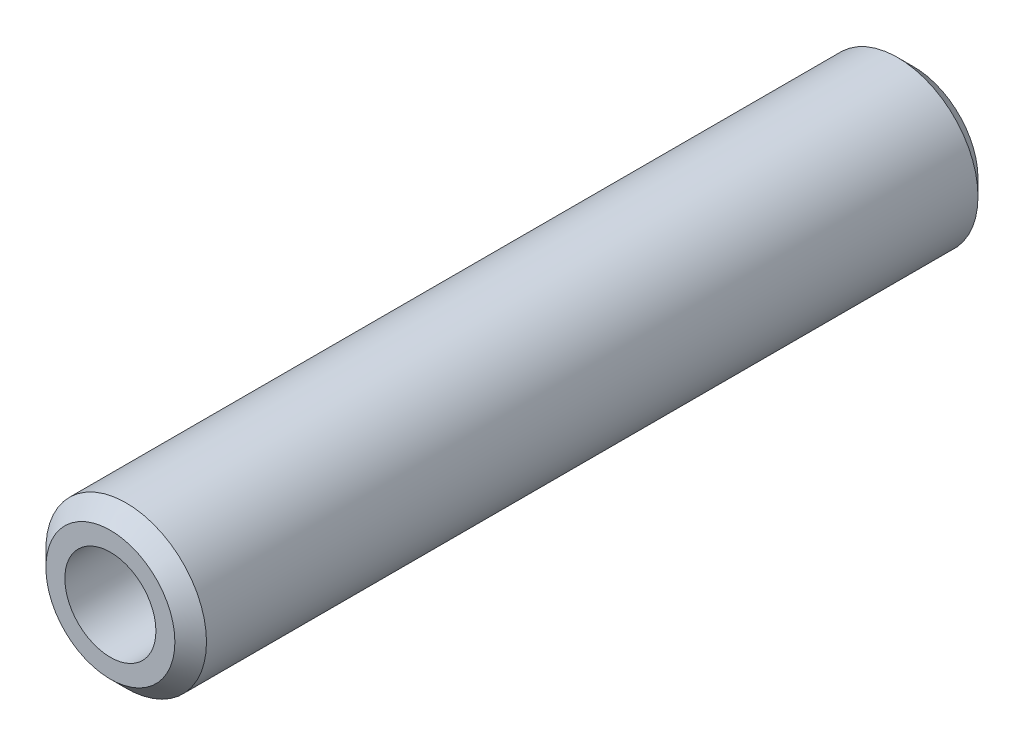
ISO-10303-21;
HEADER;
FILE_DESCRIPTION(('STEP AP214'),'2;1');
FILE_NAME('part.step','',(''),(''),'','','');
FILE_SCHEMA(('AUTOMOTIVE_DESIGN { 1 0 10303 214 1 1 1 1 }'));
ENDSEC;
DATA;
#1=APPLICATION_CONTEXT('core data for automotive mechanical design processes');
#2=APPLICATION_PROTOCOL_DEFINITION('international standard','automotive_design',2000,#1);
#3=PRODUCT_CONTEXT('',#1,'mechanical');
#4=PRODUCT('Part','Part','',(#3));
#5=PRODUCT_RELATED_PRODUCT_CATEGORY('part','',(#4));
#6=PRODUCT_DEFINITION_FORMATION('','',#4);
#7=PRODUCT_DEFINITION_CONTEXT('part definition',#1,'design');
#8=PRODUCT_DEFINITION('design','',#6,#7);
#9=PRODUCT_DEFINITION_SHAPE('','',#8);
#10=(LENGTH_UNIT() NAMED_UNIT(*) SI_UNIT(.MILLI.,.METRE.));
#11=(NAMED_UNIT(*) PLANE_ANGLE_UNIT() SI_UNIT($,.RADIAN.));
#12=(NAMED_UNIT(*) SI_UNIT($,.STERADIAN.) SOLID_ANGLE_UNIT());
#13=UNCERTAINTY_MEASURE_WITH_UNIT(LENGTH_MEASURE(1.E-05),#10,'distance_accuracy_value','');
#14=(GEOMETRIC_REPRESENTATION_CONTEXT(3) GLOBAL_UNCERTAINTY_ASSIGNED_CONTEXT((#13)) GLOBAL_UNIT_ASSIGNED_CONTEXT((#10,
#11,#12)) REPRESENTATION_CONTEXT('',''));
#15=CARTESIAN_POINT('',(0.,0.,0.));
#16=DIRECTION('',(0.,0.,1.));
#17=DIRECTION('',(1.,0.,0.));
#18=AXIS2_PLACEMENT_3D('',#15,#16,#17);
#19=CARTESIAN_POINT('',(0.,0.,63.5));
#20=DIRECTION('',(0.,0.,1.));
#21=DIRECTION('',(1.,0.,0.));
#22=AXIS2_PLACEMENT_3D('',#19,#20,#21);
#23=PLANE('',#22);
#24=CARTESIAN_POINT('',(0.,0.,63.5));
#25=DIRECTION('',(0.,0.,1.));
#26=DIRECTION('',(1.,0.,0.));
#27=AXIS2_PLACEMENT_3D('',#24,#25,#26);
#28=CIRCLE('',#27,10.2);
#29=CARTESIAN_POINT('',(10.2,0.,63.5));
#30=VERTEX_POINT('',#29);
#31=EDGE_CURVE('E10',#30,#30,#28,.T.);
#32=ORIENTED_EDGE('',*,*,#31,.T.);
#33=EDGE_LOOP('',(#32));
#34=FACE_BOUND('',#33,.T.);
#35=CARTESIAN_POINT('',(0.,0.,63.5));
#36=DIRECTION('',(0.,0.,1.));
#37=DIRECTION('',(1.,0.,0.));
#38=AXIS2_PLACEMENT_3D('',#35,#36,#37);
#39=CIRCLE('',#38,7.2);
#40=CARTESIAN_POINT('',(7.2,0.,63.5));
#41=VERTEX_POINT('',#40);
#42=EDGE_CURVE('E64',#41,#41,#39,.T.);
#43=ORIENTED_EDGE('',*,*,#42,.F.);
#44=EDGE_LOOP('',(#43));
#45=FACE_BOUND('',#44,.T.);
#46=ADVANCED_FACE('F39',(#34,#45),#23,.T.);
#47=CARTESIAN_POINT('',(0.,0.,-63.5));
#48=DIRECTION('',(0.,0.,1.));
#49=DIRECTION('',(1.,0.,0.));
#50=AXIS2_PLACEMENT_3D('',#47,#48,#49);
#51=PLANE('',#50);
#52=CARTESIAN_POINT('',(0.,0.,-63.5));
#53=DIRECTION('',(0.,0.,1.));
#54=DIRECTION('',(1.,0.,0.));
#55=AXIS2_PLACEMENT_3D('',#52,#53,#54);
#56=CIRCLE('',#55,10.2);
#57=CARTESIAN_POINT('',(10.2,0.,-63.5));
#58=VERTEX_POINT('',#57);
#59=EDGE_CURVE('E48',#58,#58,#56,.F.);
#60=ORIENTED_EDGE('',*,*,#59,.T.);
#61=EDGE_LOOP('',(#60));
#62=FACE_BOUND('',#61,.T.);
#63=CARTESIAN_POINT('',(0.,0.,-63.5));
#64=DIRECTION('',(0.,0.,1.));
#65=DIRECTION('',(1.,0.,0.));
#66=AXIS2_PLACEMENT_3D('',#63,#64,#65);
#67=CIRCLE('',#66,7.2);
#68=CARTESIAN_POINT('',(7.2,0.,-63.5));
#69=VERTEX_POINT('',#68);
#70=EDGE_CURVE('E65',#69,#69,#67,.T.);
#71=ORIENTED_EDGE('',*,*,#70,.T.);
#72=EDGE_LOOP('',(#71));
#73=FACE_BOUND('',#72,.T.);
#74=ADVANCED_FACE('F77',(#62,#73),#51,.F.);
#75=CARTESIAN_POINT('',(0.,0.,63.5));
#76=DIRECTION('',(0.,0.,-1.));
#77=DIRECTION('',(-1.,0.,0.));
#78=AXIS2_PLACEMENT_3D('',#75,#76,#77);
#79=CYLINDRICAL_SURFACE('',#78,12.7);
#80=CARTESIAN_POINT('',(0.,0.,-61.));
#81=DIRECTION('',(0.,0.,1.));
#82=DIRECTION('',(1.,0.,0.));
#83=AXIS2_PLACEMENT_3D('',#80,#81,#82);
#84=CIRCLE('',#83,12.7);
#85=CARTESIAN_POINT('',(12.7,0.,-61.));
#86=VERTEX_POINT('',#85);
#87=EDGE_CURVE('E53',#86,#86,#84,.T.);
#88=ORIENTED_EDGE('',*,*,#87,.T.);
#89=EDGE_LOOP('',(#88));
#90=FACE_BOUND('',#89,.T.);
#91=CARTESIAN_POINT('',(0.,0.,61.));
#92=DIRECTION('',(0.,0.,1.));
#93=DIRECTION('',(1.,0.,0.));
#94=AXIS2_PLACEMENT_3D('',#91,#92,#93);
#95=CIRCLE('',#94,12.7);
#96=CARTESIAN_POINT('',(12.7,0.,61.));
#97=VERTEX_POINT('',#96);
#98=EDGE_CURVE('E58',#97,#97,#95,.F.);
#99=ORIENTED_EDGE('',*,*,#98,.T.);
#100=EDGE_LOOP('',(#99));
#101=FACE_BOUND('',#100,.T.);
#102=ADVANCED_FACE('F82',(#90,#101),#79,.T.);
#103=CARTESIAN_POINT('',(0.,0.,63.5));
#104=DIRECTION('',(0.,0.,-1.));
#105=DIRECTION('',(-1.,0.,0.));
#106=AXIS2_PLACEMENT_3D('',#103,#104,#105);
#107=CYLINDRICAL_SURFACE('',#106,7.2);
#108=ORIENTED_EDGE('',*,*,#42,.T.);
#109=EDGE_LOOP('',(#108));
#110=FACE_BOUND('',#109,.T.);
#111=ORIENTED_EDGE('',*,*,#70,.F.);
#112=EDGE_LOOP('',(#111));
#113=FACE_BOUND('',#112,.T.);
#114=ADVANCED_FACE('F73',(#110,#113),#107,.F.);
#115=CARTESIAN_POINT('',(0.,0.,-61.));
#116=DIRECTION('',(0.,0.,1.));
#117=DIRECTION('',(1.,0.,0.));
#118=AXIS2_PLACEMENT_3D('',#115,#116,#117);
#119=CONICAL_SURFACE('',#118,12.7,0.78539816339745);
#120=ORIENTED_EDGE('',*,*,#59,.F.);
#121=EDGE_LOOP('',(#120));
#122=FACE_BOUND('',#121,.T.);
#123=ORIENTED_EDGE('',*,*,#87,.F.);
#124=EDGE_LOOP('',(#123));
#125=FACE_BOUND('',#124,.T.);
#126=ADVANCED_FACE('F89',(#122,#125),#119,.T.);
#127=CARTESIAN_POINT('',(0.,0.,63.5));
#128=DIRECTION('',(0.,0.,-1.));
#129=DIRECTION('',(-1.,0.,0.));
#130=AXIS2_PLACEMENT_3D('',#127,#128,#129);
#131=CONICAL_SURFACE('',#130,10.2,0.785398163397445);
#132=ORIENTED_EDGE('',*,*,#98,.F.);
#133=EDGE_LOOP('',(#132));
#134=FACE_BOUND('',#133,.T.);
#135=ORIENTED_EDGE('',*,*,#31,.F.);
#136=EDGE_LOOP('',(#135));
#137=FACE_BOUND('',#136,.T.);
#138=ADVANCED_FACE('F42',(#134,#137),#131,.T.);
#139=CLOSED_SHELL('',(#46,#74,#102,#114,#126,#138));
#140=MANIFOLD_SOLID_BREP('B2',#139);
#141=ADVANCED_BREP_SHAPE_REPRESENTATION('',(#18,#140),#14);
#142=SHAPE_DEFINITION_REPRESENTATION(#9,#141);
ENDSEC;
END-ISO-10303-21;
